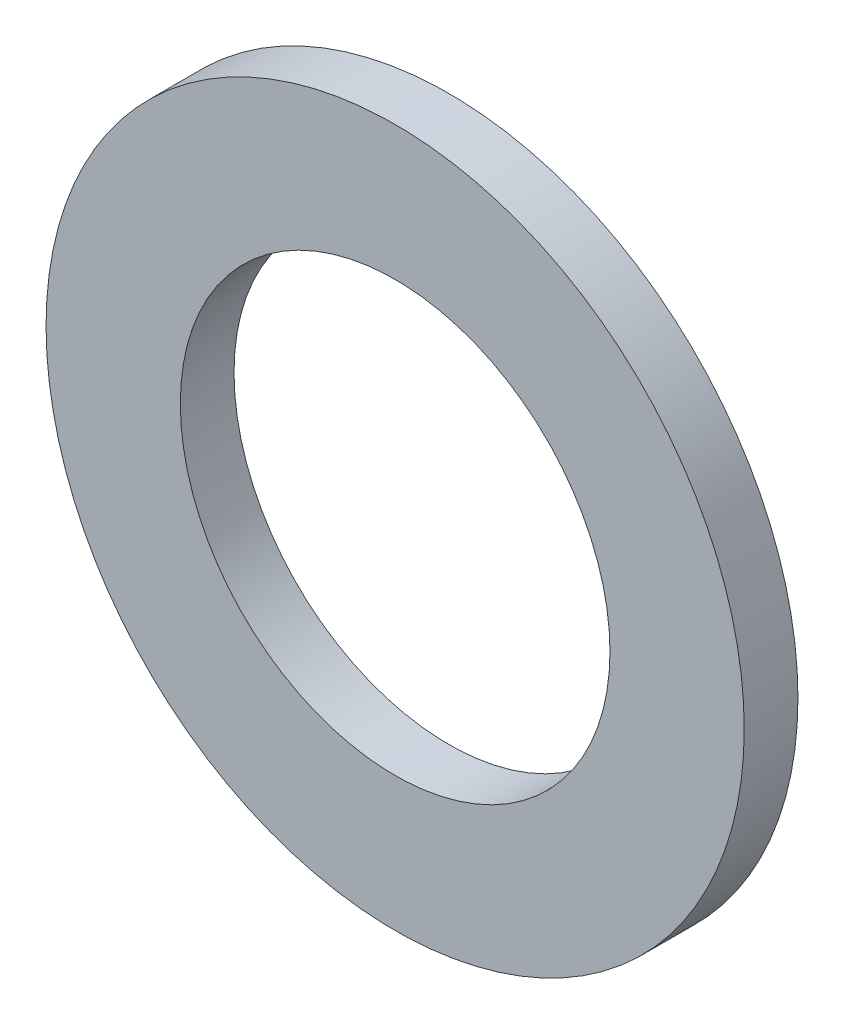
ISO-10303-21;
HEADER;
FILE_DESCRIPTION(('STEP AP214'),'2;1');
FILE_NAME('part.step','',(''),(''),'','','');
FILE_SCHEMA(('AUTOMOTIVE_DESIGN { 1 0 10303 214 1 1 1 1 }'));
ENDSEC;
DATA;
#1=APPLICATION_CONTEXT('core data for automotive mechanical design processes');
#2=APPLICATION_PROTOCOL_DEFINITION('international standard','automotive_design',2000,#1);
#3=PRODUCT_CONTEXT('',#1,'mechanical');
#4=PRODUCT('Part','Part','',(#3));
#5=PRODUCT_RELATED_PRODUCT_CATEGORY('part','',(#4));
#6=PRODUCT_DEFINITION_FORMATION('','',#4);
#7=PRODUCT_DEFINITION_CONTEXT('part definition',#1,'design');
#8=PRODUCT_DEFINITION('design','',#6,#7);
#9=PRODUCT_DEFINITION_SHAPE('','',#8);
#10=(LENGTH_UNIT() NAMED_UNIT(*) SI_UNIT(.MILLI.,.METRE.));
#11=(NAMED_UNIT(*) PLANE_ANGLE_UNIT() SI_UNIT($,.RADIAN.));
#12=(NAMED_UNIT(*) SI_UNIT($,.STERADIAN.) SOLID_ANGLE_UNIT());
#13=UNCERTAINTY_MEASURE_WITH_UNIT(LENGTH_MEASURE(1.E-05),#10,'distance_accuracy_value','');
#14=(GEOMETRIC_REPRESENTATION_CONTEXT(3) GLOBAL_UNCERTAINTY_ASSIGNED_CONTEXT((#13)) GLOBAL_UNIT_ASSIGNED_CONTEXT((#10,
#11,#12)) REPRESENTATION_CONTEXT('',''));
#15=CARTESIAN_POINT('',(0.,0.,0.));
#16=DIRECTION('',(0.,0.,1.));
#17=DIRECTION('',(1.,0.,0.));
#18=AXIS2_PLACEMENT_3D('',#15,#16,#17);
#19=CARTESIAN_POINT('',(0.,0.,1.));
#20=DIRECTION('',(0.,0.,1.));
#21=DIRECTION('',(1.,0.,0.));
#22=AXIS2_PLACEMENT_3D('',#19,#20,#21);
#23=PLANE('',#22);
#24=CARTESIAN_POINT('',(0.,0.,1.));
#25=DIRECTION('',(0.,0.,1.));
#26=DIRECTION('',(1.,0.,0.));
#27=AXIS2_PLACEMENT_3D('',#24,#25,#26);
#28=CIRCLE('',#27,6.5);
#29=CARTESIAN_POINT('',(6.5,0.,1.));
#30=VERTEX_POINT('',#29);
#31=EDGE_CURVE('E10',#30,#30,#28,.T.);
#32=ORIENTED_EDGE('',*,*,#31,.T.);
#33=EDGE_LOOP('',(#32));
#34=FACE_BOUND('',#33,.T.);
#35=CARTESIAN_POINT('',(0.,0.,1.));
#36=DIRECTION('',(0.,0.,1.));
#37=DIRECTION('',(1.,0.,0.));
#38=AXIS2_PLACEMENT_3D('',#35,#36,#37);
#39=CIRCLE('',#38,4.);
#40=CARTESIAN_POINT('',(4.,0.,1.));
#41=VERTEX_POINT('',#40);
#42=EDGE_CURVE('E41',#41,#41,#39,.T.);
#43=ORIENTED_EDGE('',*,*,#42,.F.);
#44=EDGE_LOOP('',(#43));
#45=FACE_BOUND('',#44,.T.);
#46=ADVANCED_FACE('F30',(#34,#45),#23,.T.);
#47=CARTESIAN_POINT('',(0.,0.,0.));
#48=DIRECTION('',(0.,0.,1.));
#49=DIRECTION('',(1.,0.,0.));
#50=AXIS2_PLACEMENT_3D('',#47,#48,#49);
#51=PLANE('',#50);
#52=CARTESIAN_POINT('',(0.,0.,0.));
#53=DIRECTION('',(0.,0.,1.));
#54=DIRECTION('',(1.,0.,0.));
#55=AXIS2_PLACEMENT_3D('',#52,#53,#54);
#56=CIRCLE('',#55,6.5);
#57=CARTESIAN_POINT('',(6.5,0.,0.));
#58=VERTEX_POINT('',#57);
#59=EDGE_CURVE('E34',#58,#58,#56,.T.);
#60=ORIENTED_EDGE('',*,*,#59,.F.);
#61=EDGE_LOOP('',(#60));
#62=FACE_BOUND('',#61,.T.);
#63=CARTESIAN_POINT('',(0.,0.,0.));
#64=DIRECTION('',(0.,0.,1.));
#65=DIRECTION('',(1.,0.,0.));
#66=AXIS2_PLACEMENT_3D('',#63,#64,#65);
#67=CIRCLE('',#66,4.);
#68=CARTESIAN_POINT('',(4.,0.,0.));
#69=VERTEX_POINT('',#68);
#70=EDGE_CURVE('E43',#69,#69,#67,.T.);
#71=ORIENTED_EDGE('',*,*,#70,.T.);
#72=EDGE_LOOP('',(#71));
#73=FACE_BOUND('',#72,.T.);
#74=ADVANCED_FACE('F53',(#62,#73),#51,.F.);
#75=CARTESIAN_POINT('',(0.,0.,1.));
#76=DIRECTION('',(0.,0.,-1.));
#77=DIRECTION('',(-1.,0.,0.));
#78=AXIS2_PLACEMENT_3D('',#75,#76,#77);
#79=CYLINDRICAL_SURFACE('',#78,6.5);
#80=ORIENTED_EDGE('',*,*,#31,.F.);
#81=EDGE_LOOP('',(#80));
#82=FACE_BOUND('',#81,.T.);
#83=ORIENTED_EDGE('',*,*,#59,.T.);
#84=EDGE_LOOP('',(#83));
#85=FACE_BOUND('',#84,.T.);
#86=ADVANCED_FACE('F32',(#82,#85),#79,.T.);
#87=CARTESIAN_POINT('',(0.,0.,1.));
#88=DIRECTION('',(0.,0.,-1.));
#89=DIRECTION('',(-1.,0.,0.));
#90=AXIS2_PLACEMENT_3D('',#87,#88,#89);
#91=CYLINDRICAL_SURFACE('',#90,4.);
#92=ORIENTED_EDGE('',*,*,#42,.T.);
#93=EDGE_LOOP('',(#92));
#94=FACE_BOUND('',#93,.T.);
#95=ORIENTED_EDGE('',*,*,#70,.F.);
#96=EDGE_LOOP('',(#95));
#97=FACE_BOUND('',#96,.T.);
#98=ADVANCED_FACE('F49',(#94,#97),#91,.F.);
#99=CLOSED_SHELL('',(#46,#74,#86,#98));
#100=MANIFOLD_SOLID_BREP('B2',#99);
#101=ADVANCED_BREP_SHAPE_REPRESENTATION('',(#18,#100),#14);
#102=SHAPE_DEFINITION_REPRESENTATION(#9,#101);
ENDSEC;
END-ISO-10303-21;
